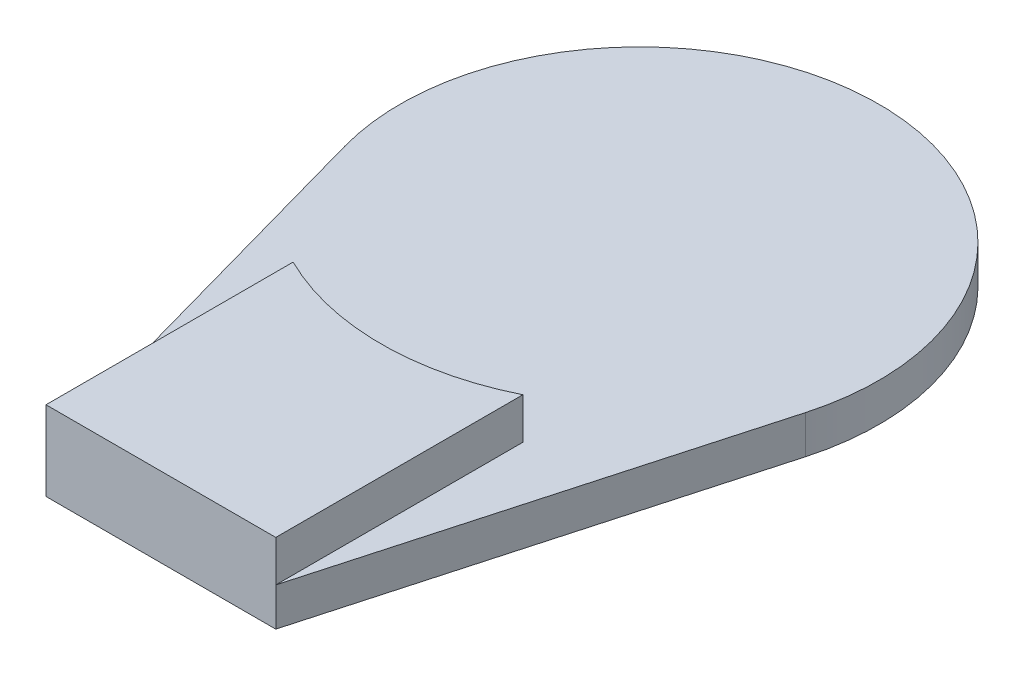
ISO-10303-21;
HEADER;
FILE_DESCRIPTION(('STEP AP214'),'2;1');
FILE_NAME('part.step','',(''),(''),'','','');
FILE_SCHEMA(('AUTOMOTIVE_DESIGN { 1 0 10303 214 1 1 1 1 }'));
ENDSEC;
DATA;
#1=APPLICATION_CONTEXT('core data for automotive mechanical design processes');
#2=APPLICATION_PROTOCOL_DEFINITION('international standard','automotive_design',2000,#1);
#3=PRODUCT_CONTEXT('',#1,'mechanical');
#4=PRODUCT('Part','Part','',(#3));
#5=PRODUCT_RELATED_PRODUCT_CATEGORY('part','',(#4));
#6=PRODUCT_DEFINITION_FORMATION('','',#4);
#7=PRODUCT_DEFINITION_CONTEXT('part definition',#1,'design');
#8=PRODUCT_DEFINITION('design','',#6,#7);
#9=PRODUCT_DEFINITION_SHAPE('','',#8);
#10=(LENGTH_UNIT() NAMED_UNIT(*) SI_UNIT(.MILLI.,.METRE.));
#11=(NAMED_UNIT(*) PLANE_ANGLE_UNIT() SI_UNIT($,.RADIAN.));
#12=(NAMED_UNIT(*) SI_UNIT($,.STERADIAN.) SOLID_ANGLE_UNIT());
#13=UNCERTAINTY_MEASURE_WITH_UNIT(LENGTH_MEASURE(1.E-05),#10,'distance_accuracy_value','');
#14=(GEOMETRIC_REPRESENTATION_CONTEXT(3) GLOBAL_UNCERTAINTY_ASSIGNED_CONTEXT((#13)) GLOBAL_UNIT_ASSIGNED_CONTEXT((#10,
#11,#12)) REPRESENTATION_CONTEXT('',''));
#15=CARTESIAN_POINT('',(0.,0.,0.));
#16=DIRECTION('',(0.,0.,1.));
#17=DIRECTION('',(1.,0.,0.));
#18=AXIS2_PLACEMENT_3D('',#15,#16,#17);
#19=CARTESIAN_POINT('',(0.,2.,0.));
#20=DIRECTION('',(0.,-1.,0.));
#21=DIRECTION('',(0.,0.,-1.));
#22=AXIS2_PLACEMENT_3D('',#19,#20,#21);
#23=CYLINDRICAL_SURFACE('',#22,12.5);
#24=CARTESIAN_POINT('',(0.,0.,0.));
#25=DIRECTION('',(0.,1.,0.));
#26=DIRECTION('',(0.,0.,1.));
#27=AXIS2_PLACEMENT_3D('',#24,#25,#26);
#28=CIRCLE('',#27,12.5);
#29=CARTESIAN_POINT('',(12.0398269377179,0.,3.3604415349477));
#30=VERTEX_POINT('',#29);
#31=CARTESIAN_POINT('',(-12.0398269377179,0.,3.3604415349477));
#32=VERTEX_POINT('',#31);
#33=EDGE_CURVE('E125',#30,#32,#28,.T.);
#34=ORIENTED_EDGE('',*,*,#33,.T.);
#35=DIRECTION('',(0.,-1.,0.));
#36=VECTOR('',#35,1.);
#37=CARTESIAN_POINT('',(-12.0398269377179,2.,3.3604415349477));
#38=LINE('',#37,#36);
#39=CARTESIAN_POINT('',(-12.0398269377179,2.,3.3604415349477));
#40=VERTEX_POINT('',#39);
#41=EDGE_CURVE('E11',#40,#32,#38,.T.);
#42=ORIENTED_EDGE('',*,*,#41,.F.);
#43=CARTESIAN_POINT('',(0.,2.,0.));
#44=DIRECTION('',(0.,1.,0.));
#45=DIRECTION('',(0.,0.,1.));
#46=AXIS2_PLACEMENT_3D('',#43,#44,#45);
#47=CIRCLE('',#46,12.5);
#48=CARTESIAN_POINT('',(12.0398269377179,2.,3.3604415349477));
#49=VERTEX_POINT('',#48);
#50=EDGE_CURVE('E134',#49,#40,#47,.T.);
#51=ORIENTED_EDGE('',*,*,#50,.F.);
#52=DIRECTION('',(0.,-1.,0.));
#53=VECTOR('',#52,1.);
#54=CARTESIAN_POINT('',(12.0398269377179,2.,3.3604415349477));
#55=LINE('',#54,#53);
#56=EDGE_CURVE('E137',#49,#30,#55,.T.);
#57=ORIENTED_EDGE('',*,*,#56,.T.);
#58=EDGE_LOOP('',(#34,#42,#51,#57));
#59=FACE_BOUND('',#58,.T.);
#60=ADVANCED_FACE('F35',(#59),#23,.T.);
#61=CARTESIAN_POINT('',(-12.0398269377179,2.,3.3604415349477));
#62=DIRECTION('',(0.963186155017435,0.,-0.268835322795816));
#63=DIRECTION('',(-0.268835322795816,0.,-0.963186155017435));
#64=AXIS2_PLACEMENT_3D('',#61,#62,#63);
#65=PLANE('',#64);
#66=DIRECTION('',(0.268835322795816,0.,0.963186155017435));
#67=VECTOR('',#66,1.);
#68=CARTESIAN_POINT('',(-12.0398269377179,0.,3.3604415349477));
#69=LINE('',#68,#67);
#70=CARTESIAN_POINT('',(-6.,0.,25.));
#71=VERTEX_POINT('',#70);
#72=EDGE_CURVE('E128',#32,#71,#69,.T.);
#73=ORIENTED_EDGE('',*,*,#72,.T.);
#74=DIRECTION('',(0.,-1.,0.));
#75=VECTOR('',#74,1.);
#76=CARTESIAN_POINT('',(-6.,2.,25.));
#77=LINE('',#76,#75);
#78=CARTESIAN_POINT('',(-6.,2.,25.));
#79=VERTEX_POINT('',#78);
#80=EDGE_CURVE('E42',#79,#71,#77,.T.);
#81=ORIENTED_EDGE('',*,*,#80,.F.);
#82=DIRECTION('',(0.268835322795816,0.,0.963186155017435));
#83=VECTOR('',#82,1.);
#84=CARTESIAN_POINT('',(-12.0398269377179,2.,3.3604415349477));
#85=LINE('',#84,#83);
#86=EDGE_CURVE('E84',#40,#79,#85,.T.);
#87=ORIENTED_EDGE('',*,*,#86,.F.);
#88=ORIENTED_EDGE('',*,*,#41,.T.);
#89=EDGE_LOOP('',(#73,#81,#87,#88));
#90=FACE_BOUND('',#89,.T.);
#91=ADVANCED_FACE('F162',(#90),#65,.F.);
#92=CARTESIAN_POINT('',(-6.,2.,25.));
#93=DIRECTION('',(0.,0.,-1.));
#94=DIRECTION('',(-1.,0.,0.));
#95=AXIS2_PLACEMENT_3D('',#92,#93,#94);
#96=PLANE('',#95);
#97=DIRECTION('',(1.,0.,0.));
#98=VECTOR('',#97,1.);
#99=CARTESIAN_POINT('',(-6.,0.,25.));
#100=LINE('',#99,#98);
#101=CARTESIAN_POINT('',(6.,0.,25.));
#102=VERTEX_POINT('',#101);
#103=EDGE_CURVE('E140',#71,#102,#100,.T.);
#104=ORIENTED_EDGE('',*,*,#103,.T.);
#105=DIRECTION('',(0.,-1.,0.));
#106=VECTOR('',#105,1.);
#107=CARTESIAN_POINT('',(6.,2.,25.));
#108=LINE('',#107,#106);
#109=CARTESIAN_POINT('',(6.,2.,25.));
#110=VERTEX_POINT('',#109);
#111=EDGE_CURVE('E124',#110,#102,#108,.T.);
#112=ORIENTED_EDGE('',*,*,#111,.F.);
#113=DIRECTION('',(0.,-1.,0.));
#114=VECTOR('',#113,1.);
#115=CARTESIAN_POINT('',(6.,4.15,25.));
#116=LINE('',#115,#114);
#117=CARTESIAN_POINT('',(6.,4.15,25.));
#118=VERTEX_POINT('',#117);
#119=EDGE_CURVE('E106',#118,#110,#116,.T.);
#120=ORIENTED_EDGE('',*,*,#119,.F.);
#121=DIRECTION('',(1.,0.,0.));
#122=VECTOR('',#121,1.);
#123=CARTESIAN_POINT('',(-6.,4.15,25.));
#124=LINE('',#123,#122);
#125=CARTESIAN_POINT('',(-6.,4.15,25.));
#126=VERTEX_POINT('',#125);
#127=EDGE_CURVE('E112',#126,#118,#124,.T.);
#128=ORIENTED_EDGE('',*,*,#127,.F.);
#129=DIRECTION('',(0.,-1.,0.));
#130=VECTOR('',#129,1.);
#131=CARTESIAN_POINT('',(-6.,4.15,25.));
#132=LINE('',#131,#130);
#133=EDGE_CURVE('E146',#126,#79,#132,.T.);
#134=ORIENTED_EDGE('',*,*,#133,.T.);
#135=ORIENTED_EDGE('',*,*,#80,.T.);
#136=EDGE_LOOP('',(#104,#112,#120,#128,#134,#135));
#137=FACE_BOUND('',#136,.T.);
#138=ADVANCED_FACE('F123',(#137),#96,.F.);
#139=CARTESIAN_POINT('',(6.,2.,25.));
#140=DIRECTION('',(-0.963186155017435,0.,-0.268835322795816));
#141=DIRECTION('',(-0.268835322795816,0.,0.963186155017435));
#142=AXIS2_PLACEMENT_3D('',#139,#140,#141);
#143=PLANE('',#142);
#144=DIRECTION('',(0.268835322795816,0.,-0.963186155017435));
#145=VECTOR('',#144,1.);
#146=CARTESIAN_POINT('',(6.,0.,25.));
#147=LINE('',#146,#145);
#148=EDGE_CURVE('E78',#102,#30,#147,.T.);
#149=ORIENTED_EDGE('',*,*,#148,.T.);
#150=ORIENTED_EDGE('',*,*,#56,.F.);
#151=DIRECTION('',(0.268835322795816,0.,-0.963186155017435));
#152=VECTOR('',#151,1.);
#153=CARTESIAN_POINT('',(6.,2.,25.));
#154=LINE('',#153,#152);
#155=EDGE_CURVE('E57',#110,#49,#154,.T.);
#156=ORIENTED_EDGE('',*,*,#155,.F.);
#157=ORIENTED_EDGE('',*,*,#111,.T.);
#158=EDGE_LOOP('',(#149,#150,#156,#157));
#159=FACE_BOUND('',#158,.T.);
#160=ADVANCED_FACE('F153',(#159),#143,.F.);
#161=CARTESIAN_POINT('',(0.,2.,0.));
#162=DIRECTION('',(0.,1.,0.));
#163=DIRECTION('',(0.,0.,1.));
#164=AXIS2_PLACEMENT_3D('',#161,#162,#163);
#165=PLANE('',#164);
#166=DIRECTION('',(0.,0.,1.));
#167=VECTOR('',#166,1.);
#168=CARTESIAN_POINT('',(-6.,2.,25.));
#169=LINE('',#168,#167);
#170=CARTESIAN_POINT('',(-6.,2.,12.0933866224478));
#171=VERTEX_POINT('',#170);
#172=EDGE_CURVE('E49',#171,#79,#169,.T.);
#173=ORIENTED_EDGE('',*,*,#172,.F.);
#174=CARTESIAN_POINT('',(0.,2.,0.));
#175=DIRECTION('',(0.,-1.,0.));
#176=DIRECTION('',(0.,0.,1.));
#177=AXIS2_PLACEMENT_3D('',#174,#175,#176);
#178=CIRCLE('',#177,13.5);
#179=CARTESIAN_POINT('',(6.,2.,12.0933866224478));
#180=VERTEX_POINT('',#179);
#181=EDGE_CURVE('E243',#180,#171,#178,.T.);
#182=ORIENTED_EDGE('',*,*,#181,.F.);
#183=DIRECTION('',(0.,0.,-1.));
#184=VECTOR('',#183,1.);
#185=CARTESIAN_POINT('',(6.,2.,25.));
#186=LINE('',#185,#184);
#187=EDGE_CURVE('E245',#110,#180,#186,.T.);
#188=ORIENTED_EDGE('',*,*,#187,.F.);
#189=ORIENTED_EDGE('',*,*,#155,.T.);
#190=ORIENTED_EDGE('',*,*,#50,.T.);
#191=ORIENTED_EDGE('',*,*,#86,.T.);
#192=EDGE_LOOP('',(#173,#182,#188,#189,#190,#191));
#193=FACE_BOUND('',#192,.T.);
#194=ADVANCED_FACE('F155',(#193),#165,.T.);
#195=CARTESIAN_POINT('',(0.,0.,0.));
#196=DIRECTION('',(0.,1.,0.));
#197=DIRECTION('',(0.,0.,1.));
#198=AXIS2_PLACEMENT_3D('',#195,#196,#197);
#199=PLANE('',#198);
#200=ORIENTED_EDGE('',*,*,#33,.F.);
#201=ORIENTED_EDGE('',*,*,#148,.F.);
#202=ORIENTED_EDGE('',*,*,#103,.F.);
#203=ORIENTED_EDGE('',*,*,#72,.F.);
#204=EDGE_LOOP('',(#200,#201,#202,#203));
#205=FACE_BOUND('',#204,.T.);
#206=ADVANCED_FACE('F149',(#205),#199,.F.);
#207=CARTESIAN_POINT('',(6.,4.15,25.));
#208=DIRECTION('',(-1.,0.,0.));
#209=DIRECTION('',(0.,0.,1.));
#210=AXIS2_PLACEMENT_3D('',#207,#208,#209);
#211=PLANE('',#210);
#212=ORIENTED_EDGE('',*,*,#187,.T.);
#213=DIRECTION('',(0.,-1.,0.));
#214=VECTOR('',#213,1.);
#215=CARTESIAN_POINT('',(6.,4.15,12.0933866224478));
#216=LINE('',#215,#214);
#217=CARTESIAN_POINT('',(6.,4.15,12.0933866224478));
#218=VERTEX_POINT('',#217);
#219=EDGE_CURVE('E108',#218,#180,#216,.T.);
#220=ORIENTED_EDGE('',*,*,#219,.F.);
#221=DIRECTION('',(0.,0.,-1.));
#222=VECTOR('',#221,1.);
#223=CARTESIAN_POINT('',(6.,4.15,25.));
#224=LINE('',#223,#222);
#225=EDGE_CURVE('E101',#118,#218,#224,.T.);
#226=ORIENTED_EDGE('',*,*,#225,.F.);
#227=ORIENTED_EDGE('',*,*,#119,.T.);
#228=EDGE_LOOP('',(#212,#220,#226,#227));
#229=FACE_BOUND('',#228,.T.);
#230=ADVANCED_FACE('F104',(#229),#211,.F.);
#231=CARTESIAN_POINT('',(0.,4.15,0.));
#232=DIRECTION('',(0.,-1.,0.));
#233=DIRECTION('',(0.,0.,-1.));
#234=AXIS2_PLACEMENT_3D('',#231,#232,#233);
#235=CYLINDRICAL_SURFACE('',#234,13.5);
#236=ORIENTED_EDGE('',*,*,#181,.T.);
#237=DIRECTION('',(0.,-1.,0.));
#238=VECTOR('',#237,1.);
#239=CARTESIAN_POINT('',(-6.,4.15,12.0933866224478));
#240=LINE('',#239,#238);
#241=CARTESIAN_POINT('',(-6.,4.15,12.0933866224478));
#242=VERTEX_POINT('',#241);
#243=EDGE_CURVE('E130',#242,#171,#240,.T.);
#244=ORIENTED_EDGE('',*,*,#243,.F.);
#245=CARTESIAN_POINT('',(0.,4.15,0.));
#246=DIRECTION('',(0.,-1.,0.));
#247=DIRECTION('',(0.,0.,1.));
#248=AXIS2_PLACEMENT_3D('',#245,#246,#247);
#249=CIRCLE('',#248,13.5);
#250=EDGE_CURVE('E111',#218,#242,#249,.T.);
#251=ORIENTED_EDGE('',*,*,#250,.F.);
#252=ORIENTED_EDGE('',*,*,#219,.T.);
#253=EDGE_LOOP('',(#236,#244,#251,#252));
#254=FACE_BOUND('',#253,.T.);
#255=ADVANCED_FACE('F198',(#254),#235,.F.);
#256=CARTESIAN_POINT('',(-6.,4.15,25.));
#257=DIRECTION('',(1.,0.,0.));
#258=DIRECTION('',(0.,0.,-1.));
#259=AXIS2_PLACEMENT_3D('',#256,#257,#258);
#260=PLANE('',#259);
#261=ORIENTED_EDGE('',*,*,#172,.T.);
#262=ORIENTED_EDGE('',*,*,#133,.F.);
#263=DIRECTION('',(0.,0.,1.));
#264=VECTOR('',#263,1.);
#265=CARTESIAN_POINT('',(-6.,4.15,25.));
#266=LINE('',#265,#264);
#267=EDGE_CURVE('E117',#242,#126,#266,.T.);
#268=ORIENTED_EDGE('',*,*,#267,.F.);
#269=ORIENTED_EDGE('',*,*,#243,.T.);
#270=EDGE_LOOP('',(#261,#262,#268,#269));
#271=FACE_BOUND('',#270,.T.);
#272=ADVANCED_FACE('F207',(#271),#260,.F.);
#273=CARTESIAN_POINT('',(0.,4.15,0.));
#274=DIRECTION('',(0.,1.,0.));
#275=DIRECTION('',(0.,0.,1.));
#276=AXIS2_PLACEMENT_3D('',#273,#274,#275);
#277=PLANE('',#276);
#278=ORIENTED_EDGE('',*,*,#127,.T.);
#279=ORIENTED_EDGE('',*,*,#225,.T.);
#280=ORIENTED_EDGE('',*,*,#250,.T.);
#281=ORIENTED_EDGE('',*,*,#267,.T.);
#282=EDGE_LOOP('',(#278,#279,#280,#281));
#283=FACE_BOUND('',#282,.T.);
#284=ADVANCED_FACE('F115',(#283),#277,.T.);
#285=CLOSED_SHELL('',(#60,#91,#138,#160,#194,#206,#230,#255,#272,#284));
#286=MANIFOLD_SOLID_BREP('B2',#285);
#287=ADVANCED_BREP_SHAPE_REPRESENTATION('',(#18,#286),#14);
#288=SHAPE_DEFINITION_REPRESENTATION(#9,#287);
ENDSEC;
END-ISO-10303-21;
